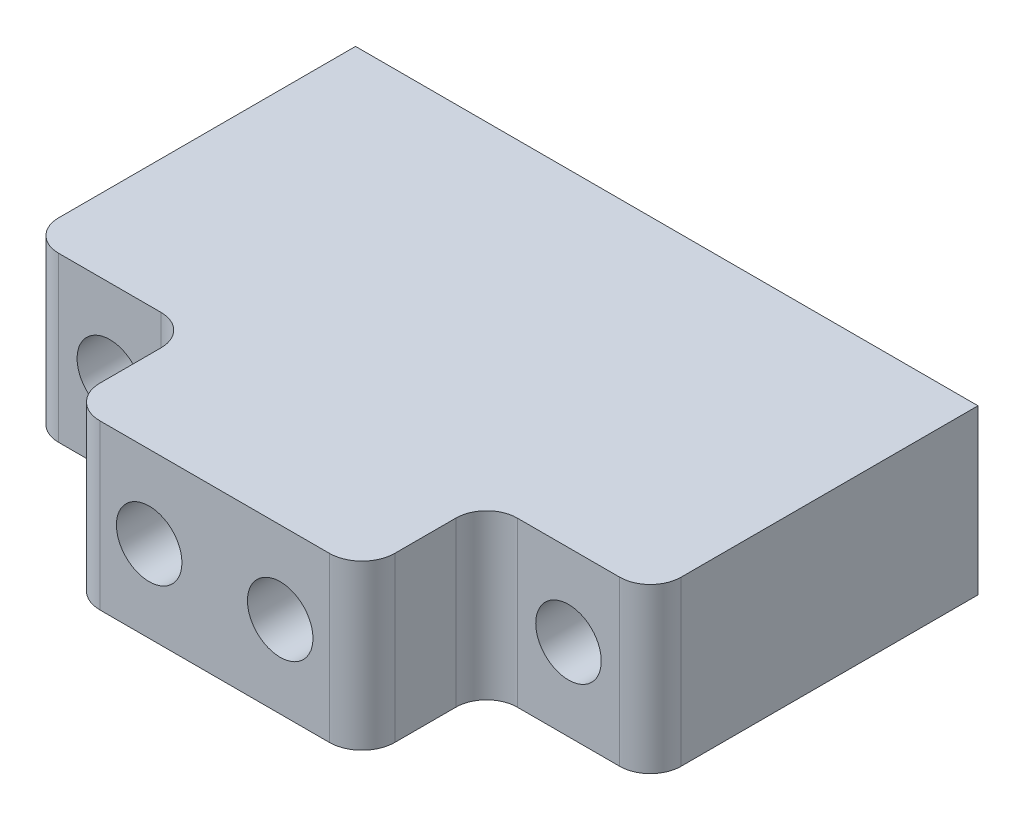
ISO-10303-21;
HEADER;
FILE_DESCRIPTION(('STEP AP214'),'2;1');
FILE_NAME('part.step','',(''),(''),'','','');
FILE_SCHEMA(('AUTOMOTIVE_DESIGN { 1 0 10303 214 1 1 1 1 }'));
ENDSEC;
DATA;
#1=APPLICATION_CONTEXT('core data for automotive mechanical design processes');
#2=APPLICATION_PROTOCOL_DEFINITION('international standard','automotive_design',2000,#1);
#3=PRODUCT_CONTEXT('',#1,'mechanical');
#4=PRODUCT('Part','Part','',(#3));
#5=PRODUCT_RELATED_PRODUCT_CATEGORY('part','',(#4));
#6=PRODUCT_DEFINITION_FORMATION('','',#4);
#7=PRODUCT_DEFINITION_CONTEXT('part definition',#1,'design');
#8=PRODUCT_DEFINITION('design','',#6,#7);
#9=PRODUCT_DEFINITION_SHAPE('','',#8);
#10=(LENGTH_UNIT() NAMED_UNIT(*) SI_UNIT(.MILLI.,.METRE.));
#11=(NAMED_UNIT(*) PLANE_ANGLE_UNIT() SI_UNIT($,.RADIAN.));
#12=(NAMED_UNIT(*) SI_UNIT($,.STERADIAN.) SOLID_ANGLE_UNIT());
#13=UNCERTAINTY_MEASURE_WITH_UNIT(LENGTH_MEASURE(1.E-05),#10,'distance_accuracy_value','');
#14=(GEOMETRIC_REPRESENTATION_CONTEXT(3) GLOBAL_UNCERTAINTY_ASSIGNED_CONTEXT((#13)) GLOBAL_UNIT_ASSIGNED_CONTEXT((#10,
#11,#12)) REPRESENTATION_CONTEXT('',''));
#15=CARTESIAN_POINT('',(0.,0.,0.));
#16=DIRECTION('',(0.,0.,1.));
#17=DIRECTION('',(1.,0.,0.));
#18=AXIS2_PLACEMENT_3D('',#15,#16,#17);
#19=CARTESIAN_POINT('',(17.78,0.,-5.08));
#20=DIRECTION('',(0.,0.,1.));
#21=DIRECTION('',(1.,0.,0.));
#22=AXIS2_PLACEMENT_3D('',#19,#20,#21);
#23=CYLINDRICAL_SURFACE('',#22,2.54);
#24=CARTESIAN_POINT('',(17.78,0.,20.32));
#25=DIRECTION('',(0.,0.,-1.));
#26=DIRECTION('',(-1.,0.,0.));
#27=AXIS2_PLACEMENT_3D('',#24,#25,#26);
#28=CIRCLE('',#27,2.54);
#29=CARTESIAN_POINT('',(15.24,0.,20.32));
#30=VERTEX_POINT('',#29);
#31=EDGE_CURVE('E199',#30,#30,#28,.T.);
#32=ORIENTED_EDGE('',*,*,#31,.F.);
#33=EDGE_LOOP('',(#32));
#34=FACE_BOUND('',#33,.T.);
#35=CARTESIAN_POINT('',(17.78,0.,-1.651));
#36=DIRECTION('',(0.,0.,-1.));
#37=DIRECTION('',(-1.,0.,0.));
#38=AXIS2_PLACEMENT_3D('',#35,#36,#37);
#39=CIRCLE('',#38,2.54);
#40=CARTESIAN_POINT('',(15.24,0.,-1.651));
#41=VERTEX_POINT('',#40);
#42=EDGE_CURVE('E196',#41,#41,#39,.F.);
#43=ORIENTED_EDGE('',*,*,#42,.F.);
#44=EDGE_LOOP('',(#43));
#45=FACE_BOUND('',#44,.T.);
#46=ADVANCED_FACE('F37',(#34,#45),#23,.F.);
#47=CARTESIAN_POINT('',(-17.78,0.,-5.08));
#48=DIRECTION('',(0.,0.,1.));
#49=DIRECTION('',(1.,0.,0.));
#50=AXIS2_PLACEMENT_3D('',#47,#48,#49);
#51=CYLINDRICAL_SURFACE('',#50,2.54);
#52=CARTESIAN_POINT('',(-17.78,0.,-1.651));
#53=DIRECTION('',(0.,0.,-1.));
#54=DIRECTION('',(-1.,0.,0.));
#55=AXIS2_PLACEMENT_3D('',#52,#53,#54);
#56=CIRCLE('',#55,2.54);
#57=CARTESIAN_POINT('',(-20.32,0.,-1.651));
#58=VERTEX_POINT('',#57);
#59=EDGE_CURVE('E191',#58,#58,#56,.F.);
#60=ORIENTED_EDGE('',*,*,#59,.F.);
#61=EDGE_LOOP('',(#60));
#62=FACE_BOUND('',#61,.T.);
#63=CARTESIAN_POINT('',(-17.78,0.,20.32));
#64=DIRECTION('',(0.,0.,-1.));
#65=DIRECTION('',(-1.,0.,0.));
#66=AXIS2_PLACEMENT_3D('',#63,#64,#65);
#67=CIRCLE('',#66,2.54);
#68=CARTESIAN_POINT('',(-20.32,0.,20.32));
#69=VERTEX_POINT('',#68);
#70=EDGE_CURVE('E241',#69,#69,#67,.T.);
#71=ORIENTED_EDGE('',*,*,#70,.F.);
#72=EDGE_LOOP('',(#71));
#73=FACE_BOUND('',#72,.T.);
#74=ADVANCED_FACE('F298',(#62,#73),#51,.F.);
#75=CARTESIAN_POINT('',(24.13,6.35,-5.08));
#76=DIRECTION('',(1.,0.,0.));
#77=DIRECTION('',(0.,0.,-1.));
#78=AXIS2_PLACEMENT_3D('',#75,#76,#77);
#79=PLANE('',#78);
#80=DIRECTION('',(0.,0.,1.));
#81=VECTOR('',#80,1.);
#82=CARTESIAN_POINT('',(24.13,6.35,-5.08));
#83=LINE('',#82,#81);
#84=CARTESIAN_POINT('',(24.13,6.35,-5.08));
#85=VERTEX_POINT('',#84);
#86=CARTESIAN_POINT('',(24.13,6.35,17.94));
#87=VERTEX_POINT('',#86);
#88=EDGE_CURVE('E135',#85,#87,#83,.T.);
#89=ORIENTED_EDGE('',*,*,#88,.T.);
#90=DIRECTION('',(0.,1.,0.));
#91=VECTOR('',#90,1.);
#92=CARTESIAN_POINT('',(24.13,6.35,17.94));
#93=LINE('',#92,#91);
#94=CARTESIAN_POINT('',(24.13,-6.35,17.94));
#95=VERTEX_POINT('',#94);
#96=EDGE_CURVE('E11',#87,#95,#93,.F.);
#97=ORIENTED_EDGE('',*,*,#96,.T.);
#98=DIRECTION('',(0.,0.,1.));
#99=VECTOR('',#98,1.);
#100=CARTESIAN_POINT('',(24.13,-6.35,-5.08));
#101=LINE('',#100,#99);
#102=CARTESIAN_POINT('',(24.13,-6.35,-5.08));
#103=VERTEX_POINT('',#102);
#104=EDGE_CURVE('E157',#103,#95,#101,.T.);
#105=ORIENTED_EDGE('',*,*,#104,.F.);
#106=DIRECTION('',(0.,1.,0.));
#107=VECTOR('',#106,1.);
#108=CARTESIAN_POINT('',(24.13,6.35,-5.08));
#109=LINE('',#108,#107);
#110=EDGE_CURVE('E150',#103,#85,#109,.T.);
#111=ORIENTED_EDGE('',*,*,#110,.T.);
#112=EDGE_LOOP('',(#89,#97,#105,#111));
#113=FACE_BOUND('',#112,.T.);
#114=ADVANCED_FACE('F155',(#113),#79,.T.);
#115=CARTESIAN_POINT('',(-24.13,-6.35000000000001,-5.08));
#116=DIRECTION('',(0.,-1.,0.));
#117=DIRECTION('',(1.,0.,0.));
#118=AXIS2_PLACEMENT_3D('',#115,#116,#117);
#119=PLANE('',#118);
#120=DIRECTION('',(1.,0.,0.));
#121=VECTOR('',#120,1.);
#122=CARTESIAN_POINT('',(-24.13,-6.35,20.32));
#123=LINE('',#122,#121);
#124=CARTESIAN_POINT('',(-21.75,-6.35,20.32));
#125=VERTEX_POINT('',#124);
#126=CARTESIAN_POINT('',(-13.81,-6.35,20.32));
#127=VERTEX_POINT('',#126);
#128=EDGE_CURVE('E244',#125,#127,#123,.T.);
#129=ORIENTED_EDGE('',*,*,#128,.F.);
#130=CARTESIAN_POINT('',(-21.75,-6.35000000000001,17.94));
#131=DIRECTION('',(0.,-1.,0.));
#132=DIRECTION('',(1.,0.,0.));
#133=AXIS2_PLACEMENT_3D('',#130,#131,#132);
#134=CIRCLE('',#133,2.38);
#135=CARTESIAN_POINT('',(-24.13,-6.35000000000001,17.94));
#136=VERTEX_POINT('',#135);
#137=EDGE_CURVE('E225',#125,#136,#134,.T.);
#138=ORIENTED_EDGE('',*,*,#137,.T.);
#139=DIRECTION('',(0.,0.,1.));
#140=VECTOR('',#139,1.);
#141=CARTESIAN_POINT('',(-24.13,-6.35000000000001,-5.08));
#142=LINE('',#141,#140);
#143=CARTESIAN_POINT('',(-24.13,-6.35000000000001,-5.08));
#144=VERTEX_POINT('',#143);
#145=EDGE_CURVE('E169',#144,#136,#142,.T.);
#146=ORIENTED_EDGE('',*,*,#145,.F.);
#147=DIRECTION('',(1.,0.,0.));
#148=VECTOR('',#147,1.);
#149=CARTESIAN_POINT('',(-24.13,-6.35000000000001,-5.08));
#150=LINE('',#149,#148);
#151=EDGE_CURVE('E143',#144,#103,#150,.T.);
#152=ORIENTED_EDGE('',*,*,#151,.T.);
#153=ORIENTED_EDGE('',*,*,#104,.T.);
#154=CARTESIAN_POINT('',(21.75,-6.35,17.94));
#155=DIRECTION('',(0.,-1.,0.));
#156=DIRECTION('',(1.,0.,0.));
#157=AXIS2_PLACEMENT_3D('',#154,#155,#156);
#158=CIRCLE('',#157,2.38);
#159=CARTESIAN_POINT('',(21.75,-6.35,20.32));
#160=VERTEX_POINT('',#159);
#161=EDGE_CURVE('E223',#95,#160,#158,.T.);
#162=ORIENTED_EDGE('',*,*,#161,.T.);
#163=DIRECTION('',(1.,0.,0.));
#164=VECTOR('',#163,1.);
#165=CARTESIAN_POINT('',(11.43,-6.35,20.32));
#166=LINE('',#165,#164);
#167=CARTESIAN_POINT('',(13.81,-6.35,20.32));
#168=VERTEX_POINT('',#167);
#169=EDGE_CURVE('E236',#168,#160,#166,.T.);
#170=ORIENTED_EDGE('',*,*,#169,.F.);
#171=CARTESIAN_POINT('',(13.81,-6.35,22.7));
#172=DIRECTION('',(0.,-1.,0.));
#173=DIRECTION('',(1.,0.,0.));
#174=AXIS2_PLACEMENT_3D('',#171,#172,#173);
#175=CIRCLE('',#174,2.38);
#176=CARTESIAN_POINT('',(11.43,-6.35,22.7));
#177=VERTEX_POINT('',#176);
#178=EDGE_CURVE('E205',#168,#177,#175,.F.);
#179=ORIENTED_EDGE('',*,*,#178,.T.);
#180=DIRECTION('',(0.,0.,-1.));
#181=VECTOR('',#180,1.);
#182=CARTESIAN_POINT('',(11.43,-6.35,27.94));
#183=LINE('',#182,#181);
#184=CARTESIAN_POINT('',(11.43,-6.35,27.432));
#185=VERTEX_POINT('',#184);
#186=EDGE_CURVE('E276',#185,#177,#183,.T.);
#187=ORIENTED_EDGE('',*,*,#186,.F.);
#188=CARTESIAN_POINT('',(8.89,-6.35000000000001,27.432));
#189=DIRECTION('',(0.,-1.,0.));
#190=DIRECTION('',(1.,0.,0.));
#191=AXIS2_PLACEMENT_3D('',#188,#189,#190);
#192=CIRCLE('',#191,2.54);
#193=CARTESIAN_POINT('',(8.89,-6.35,29.972));
#194=VERTEX_POINT('',#193);
#195=EDGE_CURVE('E186',#185,#194,#192,.T.);
#196=ORIENTED_EDGE('',*,*,#195,.T.);
#197=DIRECTION('',(1.,0.,0.));
#198=VECTOR('',#197,1.);
#199=CARTESIAN_POINT('',(-11.43,-6.35,29.972));
#200=LINE('',#199,#198);
#201=CARTESIAN_POINT('',(-8.89,-6.35,29.972));
#202=VERTEX_POINT('',#201);
#203=EDGE_CURVE('E269',#202,#194,#200,.T.);
#204=ORIENTED_EDGE('',*,*,#203,.F.);
#205=CARTESIAN_POINT('',(-8.89,-6.35000000000001,27.432));
#206=DIRECTION('',(0.,-1.,0.));
#207=DIRECTION('',(1.,0.,0.));
#208=AXIS2_PLACEMENT_3D('',#205,#206,#207);
#209=CIRCLE('',#208,2.54);
#210=CARTESIAN_POINT('',(-11.43,-6.35,27.432));
#211=VERTEX_POINT('',#210);
#212=EDGE_CURVE('E184',#202,#211,#209,.T.);
#213=ORIENTED_EDGE('',*,*,#212,.T.);
#214=DIRECTION('',(0.,0.,-1.));
#215=VECTOR('',#214,1.);
#216=CARTESIAN_POINT('',(-11.43,-6.35,27.94));
#217=LINE('',#216,#215);
#218=CARTESIAN_POINT('',(-11.43,-6.35,22.7));
#219=VERTEX_POINT('',#218);
#220=EDGE_CURVE('E161',#211,#219,#217,.T.);
#221=ORIENTED_EDGE('',*,*,#220,.T.);
#222=CARTESIAN_POINT('',(-13.81,-6.35000000000001,22.7));
#223=DIRECTION('',(0.,-1.,0.));
#224=DIRECTION('',(1.,0.,0.));
#225=AXIS2_PLACEMENT_3D('',#222,#223,#224);
#226=CIRCLE('',#225,2.38);
#227=EDGE_CURVE('E217',#219,#127,#226,.F.);
#228=ORIENTED_EDGE('',*,*,#227,.T.);
#229=EDGE_LOOP('',(#129,#138,#146,#152,#153,#162,#170,#179,#187,#196,#204,#213,#221,#228));
#230=FACE_BOUND('',#229,.T.);
#231=ADVANCED_FACE('F288',(#230),#119,.T.);
#232=CARTESIAN_POINT('',(-24.13,6.34999999999999,-5.08));
#233=DIRECTION('',(-1.,0.,0.));
#234=DIRECTION('',(0.,-1.,0.));
#235=AXIS2_PLACEMENT_3D('',#232,#233,#234);
#236=PLANE('',#235);
#237=ORIENTED_EDGE('',*,*,#145,.T.);
#238=DIRECTION('',(0.,-1.,0.));
#239=VECTOR('',#238,1.);
#240=CARTESIAN_POINT('',(-24.13,6.34999999999999,17.94));
#241=LINE('',#240,#239);
#242=CARTESIAN_POINT('',(-24.13,6.34999999999999,17.94));
#243=VERTEX_POINT('',#242);
#244=EDGE_CURVE('E227',#136,#243,#241,.F.);
#245=ORIENTED_EDGE('',*,*,#244,.T.);
#246=DIRECTION('',(0.,0.,1.));
#247=VECTOR('',#246,1.);
#248=CARTESIAN_POINT('',(-24.13,6.34999999999999,-5.08));
#249=LINE('',#248,#247);
#250=CARTESIAN_POINT('',(-24.13,6.34999999999999,-5.08));
#251=VERTEX_POINT('',#250);
#252=EDGE_CURVE('E142',#251,#243,#249,.T.);
#253=ORIENTED_EDGE('',*,*,#252,.F.);
#254=DIRECTION('',(0.,-1.,0.));
#255=VECTOR('',#254,1.);
#256=CARTESIAN_POINT('',(-24.13,6.34999999999999,-5.08));
#257=LINE('',#256,#255);
#258=EDGE_CURVE('E153',#251,#144,#257,.T.);
#259=ORIENTED_EDGE('',*,*,#258,.T.);
#260=EDGE_LOOP('',(#237,#245,#253,#259));
#261=FACE_BOUND('',#260,.T.);
#262=ADVANCED_FACE('F317',(#261),#236,.T.);
#263=CARTESIAN_POINT('',(-24.13,6.34999999999999,-5.08));
#264=DIRECTION('',(0.,1.,0.));
#265=DIRECTION('',(-1.,0.,0.));
#266=AXIS2_PLACEMENT_3D('',#263,#264,#265);
#267=PLANE('',#266);
#268=ORIENTED_EDGE('',*,*,#252,.T.);
#269=CARTESIAN_POINT('',(-21.75,6.34999999999999,17.94));
#270=DIRECTION('',(0.,1.,0.));
#271=DIRECTION('',(-1.,0.,0.));
#272=AXIS2_PLACEMENT_3D('',#269,#270,#271);
#273=CIRCLE('',#272,2.38);
#274=CARTESIAN_POINT('',(-21.75,6.34999999999999,20.32));
#275=VERTEX_POINT('',#274);
#276=EDGE_CURVE('E230',#243,#275,#273,.T.);
#277=ORIENTED_EDGE('',*,*,#276,.T.);
#278=DIRECTION('',(-1.,0.,0.));
#279=VECTOR('',#278,1.);
#280=CARTESIAN_POINT('',(-24.13,6.34999999999999,20.32));
#281=LINE('',#280,#279);
#282=CARTESIAN_POINT('',(-13.81,6.34999999999999,20.32));
#283=VERTEX_POINT('',#282);
#284=EDGE_CURVE('E250',#283,#275,#281,.T.);
#285=ORIENTED_EDGE('',*,*,#284,.F.);
#286=CARTESIAN_POINT('',(-13.81,6.35,22.7));
#287=DIRECTION('',(0.,1.,0.));
#288=DIRECTION('',(-1.,0.,0.));
#289=AXIS2_PLACEMENT_3D('',#286,#287,#288);
#290=CIRCLE('',#289,2.38);
#291=CARTESIAN_POINT('',(-11.43,6.35,22.7));
#292=VERTEX_POINT('',#291);
#293=EDGE_CURVE('E215',#283,#292,#290,.F.);
#294=ORIENTED_EDGE('',*,*,#293,.T.);
#295=DIRECTION('',(0.,0.,-1.));
#296=VECTOR('',#295,1.);
#297=CARTESIAN_POINT('',(-11.43,6.35,27.94));
#298=LINE('',#297,#296);
#299=CARTESIAN_POINT('',(-11.43,6.35,27.432));
#300=VERTEX_POINT('',#299);
#301=EDGE_CURVE('E158',#300,#292,#298,.T.);
#302=ORIENTED_EDGE('',*,*,#301,.F.);
#303=CARTESIAN_POINT('',(-8.89,6.35,27.432));
#304=DIRECTION('',(0.,1.,0.));
#305=DIRECTION('',(-1.,0.,0.));
#306=AXIS2_PLACEMENT_3D('',#303,#304,#305);
#307=CIRCLE('',#306,2.54);
#308=CARTESIAN_POINT('',(-8.89,6.35,29.972));
#309=VERTEX_POINT('',#308);
#310=EDGE_CURVE('E178',#300,#309,#307,.T.);
#311=ORIENTED_EDGE('',*,*,#310,.T.);
#312=DIRECTION('',(-1.,0.,0.));
#313=VECTOR('',#312,1.);
#314=CARTESIAN_POINT('',(-11.43,6.35,29.972));
#315=LINE('',#314,#313);
#316=CARTESIAN_POINT('',(8.89,6.35,29.972));
#317=VERTEX_POINT('',#316);
#318=EDGE_CURVE('E272',#317,#309,#315,.T.);
#319=ORIENTED_EDGE('',*,*,#318,.F.);
#320=CARTESIAN_POINT('',(8.89,6.35,27.432));
#321=DIRECTION('',(0.,1.,0.));
#322=DIRECTION('',(-1.,0.,0.));
#323=AXIS2_PLACEMENT_3D('',#320,#321,#322);
#324=CIRCLE('',#323,2.54);
#325=CARTESIAN_POINT('',(11.43,6.35,27.432));
#326=VERTEX_POINT('',#325);
#327=EDGE_CURVE('E180',#317,#326,#324,.T.);
#328=ORIENTED_EDGE('',*,*,#327,.T.);
#329=DIRECTION('',(0.,0.,-1.));
#330=VECTOR('',#329,1.);
#331=CARTESIAN_POINT('',(11.43,6.35,27.94));
#332=LINE('',#331,#330);
#333=CARTESIAN_POINT('',(11.43,6.35,22.7));
#334=VERTEX_POINT('',#333);
#335=EDGE_CURVE('E275',#326,#334,#332,.T.);
#336=ORIENTED_EDGE('',*,*,#335,.T.);
#337=CARTESIAN_POINT('',(13.81,6.35,22.7));
#338=DIRECTION('',(0.,1.,0.));
#339=DIRECTION('',(-1.,0.,0.));
#340=AXIS2_PLACEMENT_3D('',#337,#338,#339);
#341=CIRCLE('',#340,2.38);
#342=CARTESIAN_POINT('',(13.81,6.35,20.32));
#343=VERTEX_POINT('',#342);
#344=EDGE_CURVE('E207',#334,#343,#341,.F.);
#345=ORIENTED_EDGE('',*,*,#344,.T.);
#346=DIRECTION('',(-1.,0.,0.));
#347=VECTOR('',#346,1.);
#348=CARTESIAN_POINT('',(11.43,6.35,20.32));
#349=LINE('',#348,#347);
#350=CARTESIAN_POINT('',(21.75,6.35,20.32));
#351=VERTEX_POINT('',#350);
#352=EDGE_CURVE('E234',#351,#343,#349,.T.);
#353=ORIENTED_EDGE('',*,*,#352,.F.);
#354=CARTESIAN_POINT('',(21.75,6.35,17.94));
#355=DIRECTION('',(0.,1.,0.));
#356=DIRECTION('',(-1.,0.,0.));
#357=AXIS2_PLACEMENT_3D('',#354,#355,#356);
#358=CIRCLE('',#357,2.38);
#359=EDGE_CURVE('E52',#351,#87,#358,.T.);
#360=ORIENTED_EDGE('',*,*,#359,.T.);
#361=ORIENTED_EDGE('',*,*,#88,.F.);
#362=DIRECTION('',(-1.,0.,0.));
#363=VECTOR('',#362,1.);
#364=CARTESIAN_POINT('',(-24.13,6.34999999999999,-5.08));
#365=LINE('',#364,#363);
#366=EDGE_CURVE('E139',#85,#251,#365,.T.);
#367=ORIENTED_EDGE('',*,*,#366,.T.);
#368=EDGE_LOOP('',(#268,#277,#285,#294,#302,#311,#319,#328,#336,#345,#353,#360,#361,#367));
#369=FACE_BOUND('',#368,.T.);
#370=ADVANCED_FACE('F138',(#369),#267,.T.);
#371=CARTESIAN_POINT('',(0.,0.,-5.08));
#372=DIRECTION('',(0.,0.,1.));
#373=DIRECTION('',(1.,0.,0.));
#374=AXIS2_PLACEMENT_3D('',#371,#372,#373);
#375=PLANE('',#374);
#376=CARTESIAN_POINT('',(17.78,0.,-5.08));
#377=DIRECTION('',(0.,0.,-1.));
#378=DIRECTION('',(-1.,0.,0.));
#379=AXIS2_PLACEMENT_3D('',#376,#377,#378);
#380=CIRCLE('',#379,4.8006);
#381=CARTESIAN_POINT('',(12.9794,0.,-5.08));
#382=VERTEX_POINT('',#381);
#383=EDGE_CURVE('E407',#382,#382,#380,.T.);
#384=ORIENTED_EDGE('',*,*,#383,.F.);
#385=EDGE_LOOP('',(#384));
#386=FACE_BOUND('',#385,.T.);
#387=CARTESIAN_POINT('',(-17.78,0.,-5.08));
#388=DIRECTION('',(0.,0.,-1.));
#389=DIRECTION('',(-1.,0.,0.));
#390=AXIS2_PLACEMENT_3D('',#387,#388,#389);
#391=CIRCLE('',#390,4.8006);
#392=CARTESIAN_POINT('',(-22.5806,0.,-5.08));
#393=VERTEX_POINT('',#392);
#394=EDGE_CURVE('E253',#393,#393,#391,.T.);
#395=ORIENTED_EDGE('',*,*,#394,.F.);
#396=EDGE_LOOP('',(#395));
#397=FACE_BOUND('',#396,.T.);
#398=ORIENTED_EDGE('',*,*,#110,.F.);
#399=ORIENTED_EDGE('',*,*,#151,.F.);
#400=ORIENTED_EDGE('',*,*,#258,.F.);
#401=ORIENTED_EDGE('',*,*,#366,.F.);
#402=EDGE_LOOP('',(#398,#399,#400,#401));
#403=FACE_BOUND('',#402,.T.);
#404=ADVANCED_FACE('F148',(#386,#397,#403),#375,.F.);
#405=CARTESIAN_POINT('',(-11.43,6.35,27.94));
#406=DIRECTION('',(1.,0.,0.));
#407=DIRECTION('',(0.,0.,-1.));
#408=AXIS2_PLACEMENT_3D('',#405,#406,#407);
#409=PLANE('',#408);
#410=ORIENTED_EDGE('',*,*,#301,.T.);
#411=DIRECTION('',(0.,1.,0.));
#412=VECTOR('',#411,1.);
#413=CARTESIAN_POINT('',(-11.43,6.35,22.7));
#414=LINE('',#413,#412);
#415=EDGE_CURVE('E213',#292,#219,#414,.F.);
#416=ORIENTED_EDGE('',*,*,#415,.T.);
#417=ORIENTED_EDGE('',*,*,#220,.F.);
#418=DIRECTION('',(0.,-1.,0.));
#419=VECTOR('',#418,1.);
#420=CARTESIAN_POINT('',(-11.43,6.35,27.432));
#421=LINE('',#420,#419);
#422=EDGE_CURVE('E188',#211,#300,#421,.F.);
#423=ORIENTED_EDGE('',*,*,#422,.T.);
#424=EDGE_LOOP('',(#410,#416,#417,#423));
#425=FACE_BOUND('',#424,.T.);
#426=ADVANCED_FACE('F309',(#425),#409,.F.);
#427=CARTESIAN_POINT('',(11.43,6.35,27.94));
#428=DIRECTION('',(1.,0.,0.));
#429=DIRECTION('',(0.,0.,-1.));
#430=AXIS2_PLACEMENT_3D('',#427,#428,#429);
#431=PLANE('',#430);
#432=ORIENTED_EDGE('',*,*,#186,.T.);
#433=DIRECTION('',(0.,-1.,0.));
#434=VECTOR('',#433,1.);
#435=CARTESIAN_POINT('',(11.43,6.35,22.7));
#436=LINE('',#435,#434);
#437=EDGE_CURVE('E203',#177,#334,#436,.F.);
#438=ORIENTED_EDGE('',*,*,#437,.T.);
#439=ORIENTED_EDGE('',*,*,#335,.F.);
#440=DIRECTION('',(0.,1.,0.));
#441=VECTOR('',#440,1.);
#442=CARTESIAN_POINT('',(11.43,6.35,27.432));
#443=LINE('',#442,#441);
#444=EDGE_CURVE('E182',#326,#185,#443,.F.);
#445=ORIENTED_EDGE('',*,*,#444,.T.);
#446=EDGE_LOOP('',(#432,#438,#439,#445));
#447=FACE_BOUND('',#446,.T.);
#448=ADVANCED_FACE('F357',(#447),#431,.T.);
#449=CARTESIAN_POINT('',(0.,0.,29.972));
#450=DIRECTION('',(0.,0.,1.));
#451=DIRECTION('',(1.,0.,0.));
#452=AXIS2_PLACEMENT_3D('',#449,#450,#451);
#453=PLANE('',#452);
#454=CARTESIAN_POINT('',(5.08,0.,29.972));
#455=DIRECTION('',(0.,0.,1.));
#456=DIRECTION('',(1.,0.,0.));
#457=AXIS2_PLACEMENT_3D('',#454,#455,#456);
#458=CIRCLE('',#457,2.54);
#459=CARTESIAN_POINT('',(7.62,0.,29.972));
#460=VERTEX_POINT('',#459);
#461=EDGE_CURVE('E263',#460,#460,#458,.T.);
#462=ORIENTED_EDGE('',*,*,#461,.F.);
#463=EDGE_LOOP('',(#462));
#464=FACE_BOUND('',#463,.T.);
#465=CARTESIAN_POINT('',(-5.08,0.,29.972));
#466=DIRECTION('',(0.,0.,1.));
#467=DIRECTION('',(1.,0.,0.));
#468=AXIS2_PLACEMENT_3D('',#465,#466,#467);
#469=CIRCLE('',#468,2.54);
#470=CARTESIAN_POINT('',(-2.54,0.,29.972));
#471=VERTEX_POINT('',#470);
#472=EDGE_CURVE('E266',#471,#471,#469,.T.);
#473=ORIENTED_EDGE('',*,*,#472,.F.);
#474=EDGE_LOOP('',(#473));
#475=FACE_BOUND('',#474,.T.);
#476=ORIENTED_EDGE('',*,*,#203,.T.);
#477=DIRECTION('',(0.,1.,0.));
#478=VECTOR('',#477,1.);
#479=CARTESIAN_POINT('',(8.89,0.,29.972));
#480=LINE('',#479,#478);
#481=EDGE_CURVE('E175',#194,#317,#480,.T.);
#482=ORIENTED_EDGE('',*,*,#481,.T.);
#483=ORIENTED_EDGE('',*,*,#318,.T.);
#484=DIRECTION('',(0.,-1.,0.));
#485=VECTOR('',#484,1.);
#486=CARTESIAN_POINT('',(-8.89,-6.35,29.972));
#487=LINE('',#486,#485);
#488=EDGE_CURVE('E168',#309,#202,#487,.T.);
#489=ORIENTED_EDGE('',*,*,#488,.T.);
#490=EDGE_LOOP('',(#476,#482,#483,#489));
#491=FACE_BOUND('',#490,.T.);
#492=ADVANCED_FACE('F354',(#464,#475,#491),#453,.T.);
#493=CARTESIAN_POINT('',(-5.08,0.,27.94));
#494=DIRECTION('',(0.,0.,1.));
#495=DIRECTION('',(1.,0.,0.));
#496=AXIS2_PLACEMENT_3D('',#493,#494,#495);
#497=CYLINDRICAL_SURFACE('',#496,2.54);
#498=ORIENTED_EDGE('',*,*,#472,.T.);
#499=EDGE_LOOP('',(#498));
#500=FACE_BOUND('',#499,.T.);
#501=CARTESIAN_POINT('',(-5.08,0.,20.447));
#502=DIRECTION('',(0.,0.,1.));
#503=DIRECTION('',(1.,0.,0.));
#504=AXIS2_PLACEMENT_3D('',#501,#502,#503);
#505=CIRCLE('',#504,2.54);
#506=CARTESIAN_POINT('',(-2.54,0.,20.447));
#507=VERTEX_POINT('',#506);
#508=EDGE_CURVE('E260',#507,#507,#505,.T.);
#509=ORIENTED_EDGE('',*,*,#508,.F.);
#510=EDGE_LOOP('',(#509));
#511=FACE_BOUND('',#510,.T.);
#512=ADVANCED_FACE('F363',(#500,#511),#497,.F.);
#513=CARTESIAN_POINT('',(5.08,0.,27.94));
#514=DIRECTION('',(0.,0.,1.));
#515=DIRECTION('',(1.,0.,0.));
#516=AXIS2_PLACEMENT_3D('',#513,#514,#515);
#517=CYLINDRICAL_SURFACE('',#516,2.54);
#518=ORIENTED_EDGE('',*,*,#461,.T.);
#519=EDGE_LOOP('',(#518));
#520=FACE_BOUND('',#519,.T.);
#521=CARTESIAN_POINT('',(5.08,0.,20.447));
#522=DIRECTION('',(0.,0.,1.));
#523=DIRECTION('',(1.,0.,0.));
#524=AXIS2_PLACEMENT_3D('',#521,#522,#523);
#525=CIRCLE('',#524,2.54);
#526=CARTESIAN_POINT('',(7.62,0.,20.447));
#527=VERTEX_POINT('',#526);
#528=EDGE_CURVE('E194',#527,#527,#525,.T.);
#529=ORIENTED_EDGE('',*,*,#528,.F.);
#530=EDGE_LOOP('',(#529));
#531=FACE_BOUND('',#530,.T.);
#532=ADVANCED_FACE('F329',(#520,#531),#517,.F.);
#533=CARTESIAN_POINT('',(8.89,0.,27.432));
#534=DIRECTION('',(0.,1.,0.));
#535=DIRECTION('',(0.,0.,1.));
#536=AXIS2_PLACEMENT_3D('',#533,#534,#535);
#537=CYLINDRICAL_SURFACE('',#536,2.54);
#538=ORIENTED_EDGE('',*,*,#195,.F.);
#539=ORIENTED_EDGE('',*,*,#444,.F.);
#540=ORIENTED_EDGE('',*,*,#327,.F.);
#541=ORIENTED_EDGE('',*,*,#481,.F.);
#542=EDGE_LOOP('',(#538,#539,#540,#541));
#543=FACE_BOUND('',#542,.T.);
#544=ADVANCED_FACE('F325',(#543),#537,.T.);
#545=CARTESIAN_POINT('',(-8.89,0.,27.432));
#546=DIRECTION('',(0.,1.,0.));
#547=DIRECTION('',(0.,0.,1.));
#548=AXIS2_PLACEMENT_3D('',#545,#546,#547);
#549=CYLINDRICAL_SURFACE('',#548,2.54);
#550=ORIENTED_EDGE('',*,*,#310,.F.);
#551=ORIENTED_EDGE('',*,*,#422,.F.);
#552=ORIENTED_EDGE('',*,*,#212,.F.);
#553=ORIENTED_EDGE('',*,*,#488,.F.);
#554=EDGE_LOOP('',(#550,#551,#552,#553));
#555=FACE_BOUND('',#554,.T.);
#556=ADVANCED_FACE('F328',(#555),#549,.T.);
#557=CARTESIAN_POINT('',(-5.08,0.,20.447));
#558=DIRECTION('',(0.,0.,1.));
#559=DIRECTION('',(1.,0.,0.));
#560=AXIS2_PLACEMENT_3D('',#557,#558,#559);
#561=PLANE('',#560);
#562=ORIENTED_EDGE('',*,*,#508,.T.);
#563=EDGE_LOOP('',(#562));
#564=FACE_BOUND('',#563,.T.);
#565=ADVANCED_FACE('F333',(#564),#561,.T.);
#566=CARTESIAN_POINT('',(5.08,0.,20.447));
#567=DIRECTION('',(0.,0.,1.));
#568=DIRECTION('',(1.,0.,0.));
#569=AXIS2_PLACEMENT_3D('',#566,#567,#568);
#570=PLANE('',#569);
#571=ORIENTED_EDGE('',*,*,#528,.T.);
#572=EDGE_LOOP('',(#571));
#573=FACE_BOUND('',#572,.T.);
#574=ADVANCED_FACE('F375',(#573),#570,.T.);
#575=CARTESIAN_POINT('',(-17.78,0.,-1.651));
#576=DIRECTION('',(0.,0.,-1.));
#577=DIRECTION('',(-1.,0.,0.));
#578=AXIS2_PLACEMENT_3D('',#575,#576,#577);
#579=PLANE('',#578);
#580=CARTESIAN_POINT('',(-17.78,0.,-1.651));
#581=DIRECTION('',(0.,0.,-1.));
#582=DIRECTION('',(-1.,0.,0.));
#583=AXIS2_PLACEMENT_3D('',#580,#581,#582);
#584=CIRCLE('',#583,4.8006);
#585=CARTESIAN_POINT('',(-22.5806,0.,-1.651));
#586=VERTEX_POINT('',#585);
#587=EDGE_CURVE('E195',#586,#586,#584,.T.);
#588=ORIENTED_EDGE('',*,*,#587,.T.);
#589=EDGE_LOOP('',(#588));
#590=FACE_BOUND('',#589,.T.);
#591=ORIENTED_EDGE('',*,*,#59,.T.);
#592=EDGE_LOOP('',(#591));
#593=FACE_BOUND('',#592,.T.);
#594=ADVANCED_FACE('F379',(#590,#593),#579,.T.);
#595=CARTESIAN_POINT('',(-17.78,0.,-1.651));
#596=DIRECTION('',(0.,0.,-1.));
#597=DIRECTION('',(-1.,0.,0.));
#598=AXIS2_PLACEMENT_3D('',#595,#596,#597);
#599=CYLINDRICAL_SURFACE('',#598,4.8006);
#600=ORIENTED_EDGE('',*,*,#587,.F.);
#601=EDGE_LOOP('',(#600));
#602=FACE_BOUND('',#601,.T.);
#603=ORIENTED_EDGE('',*,*,#394,.T.);
#604=EDGE_LOOP('',(#603));
#605=FACE_BOUND('',#604,.T.);
#606=ADVANCED_FACE('F381',(#602,#605),#599,.F.);
#607=CARTESIAN_POINT('',(0.,0.,20.32));
#608=DIRECTION('',(0.,0.,1.));
#609=DIRECTION('',(1.,0.,0.));
#610=AXIS2_PLACEMENT_3D('',#607,#608,#609);
#611=PLANE('',#610);
#612=ORIENTED_EDGE('',*,*,#70,.T.);
#613=EDGE_LOOP('',(#612));
#614=FACE_BOUND('',#613,.T.);
#615=ORIENTED_EDGE('',*,*,#284,.T.);
#616=DIRECTION('',(0.,-1.,0.));
#617=VECTOR('',#616,1.);
#618=CARTESIAN_POINT('',(-21.75,0.,20.32));
#619=LINE('',#618,#617);
#620=EDGE_CURVE('E220',#275,#125,#619,.T.);
#621=ORIENTED_EDGE('',*,*,#620,.T.);
#622=ORIENTED_EDGE('',*,*,#128,.T.);
#623=DIRECTION('',(0.,1.,0.));
#624=VECTOR('',#623,1.);
#625=CARTESIAN_POINT('',(-13.81,0.,20.32));
#626=LINE('',#625,#624);
#627=EDGE_CURVE('E210',#127,#283,#626,.T.);
#628=ORIENTED_EDGE('',*,*,#627,.T.);
#629=EDGE_LOOP('',(#615,#621,#622,#628));
#630=FACE_BOUND('',#629,.T.);
#631=ADVANCED_FACE('F384',(#614,#630),#611,.T.);
#632=CARTESIAN_POINT('',(0.,0.,20.32));
#633=DIRECTION('',(0.,0.,1.));
#634=DIRECTION('',(1.,0.,0.));
#635=AXIS2_PLACEMENT_3D('',#632,#633,#634);
#636=PLANE('',#635);
#637=ORIENTED_EDGE('',*,*,#31,.T.);
#638=EDGE_LOOP('',(#637));
#639=FACE_BOUND('',#638,.T.);
#640=ORIENTED_EDGE('',*,*,#169,.T.);
#641=DIRECTION('',(0.,1.,0.));
#642=VECTOR('',#641,1.);
#643=CARTESIAN_POINT('',(21.75,0.,20.32));
#644=LINE('',#643,#642);
#645=EDGE_CURVE('E45',#160,#351,#644,.T.);
#646=ORIENTED_EDGE('',*,*,#645,.T.);
#647=ORIENTED_EDGE('',*,*,#352,.T.);
#648=DIRECTION('',(0.,-1.,0.));
#649=VECTOR('',#648,1.);
#650=CARTESIAN_POINT('',(13.81,-6.35,20.32));
#651=LINE('',#650,#649);
#652=EDGE_CURVE('E190',#343,#168,#651,.T.);
#653=ORIENTED_EDGE('',*,*,#652,.T.);
#654=EDGE_LOOP('',(#640,#646,#647,#653));
#655=FACE_BOUND('',#654,.T.);
#656=ADVANCED_FACE('F233',(#639,#655),#636,.T.);
#657=CARTESIAN_POINT('',(17.78,0.,-1.651));
#658=DIRECTION('',(0.,0.,-1.));
#659=DIRECTION('',(-1.,0.,0.));
#660=AXIS2_PLACEMENT_3D('',#657,#658,#659);
#661=PLANE('',#660);
#662=CARTESIAN_POINT('',(17.78,0.,-1.651));
#663=DIRECTION('',(0.,0.,-1.));
#664=DIRECTION('',(-1.,0.,0.));
#665=AXIS2_PLACEMENT_3D('',#662,#663,#664);
#666=CIRCLE('',#665,4.8006);
#667=CARTESIAN_POINT('',(12.9794,0.,-1.651));
#668=VERTEX_POINT('',#667);
#669=EDGE_CURVE('E200',#668,#668,#666,.T.);
#670=ORIENTED_EDGE('',*,*,#669,.T.);
#671=EDGE_LOOP('',(#670));
#672=FACE_BOUND('',#671,.T.);
#673=ORIENTED_EDGE('',*,*,#42,.T.);
#674=EDGE_LOOP('',(#673));
#675=FACE_BOUND('',#674,.T.);
#676=ADVANCED_FACE('F394',(#672,#675),#661,.T.);
#677=CARTESIAN_POINT('',(17.78,0.,-1.651));
#678=DIRECTION('',(0.,0.,-1.));
#679=DIRECTION('',(-1.,0.,0.));
#680=AXIS2_PLACEMENT_3D('',#677,#678,#679);
#681=CYLINDRICAL_SURFACE('',#680,4.8006);
#682=ORIENTED_EDGE('',*,*,#669,.F.);
#683=EDGE_LOOP('',(#682));
#684=FACE_BOUND('',#683,.T.);
#685=ORIENTED_EDGE('',*,*,#383,.T.);
#686=EDGE_LOOP('',(#685));
#687=FACE_BOUND('',#686,.T.);
#688=ADVANCED_FACE('F337',(#684,#687),#681,.F.);
#689=CARTESIAN_POINT('',(13.81,0.,22.7));
#690=DIRECTION('',(0.,1.,0.));
#691=DIRECTION('',(0.,0.,1.));
#692=AXIS2_PLACEMENT_3D('',#689,#690,#691);
#693=CYLINDRICAL_SURFACE('',#692,2.38);
#694=ORIENTED_EDGE('',*,*,#344,.F.);
#695=ORIENTED_EDGE('',*,*,#437,.F.);
#696=ORIENTED_EDGE('',*,*,#178,.F.);
#697=ORIENTED_EDGE('',*,*,#652,.F.);
#698=EDGE_LOOP('',(#694,#695,#696,#697));
#699=FACE_BOUND('',#698,.T.);
#700=ADVANCED_FACE('F285',(#699),#693,.F.);
#701=CARTESIAN_POINT('',(-13.81,0.,22.7));
#702=DIRECTION('',(0.,1.,0.));
#703=DIRECTION('',(0.,0.,1.));
#704=AXIS2_PLACEMENT_3D('',#701,#702,#703);
#705=CYLINDRICAL_SURFACE('',#704,2.38);
#706=ORIENTED_EDGE('',*,*,#227,.F.);
#707=ORIENTED_EDGE('',*,*,#415,.F.);
#708=ORIENTED_EDGE('',*,*,#293,.F.);
#709=ORIENTED_EDGE('',*,*,#627,.F.);
#710=EDGE_LOOP('',(#706,#707,#708,#709));
#711=FACE_BOUND('',#710,.T.);
#712=ADVANCED_FACE('F295',(#711),#705,.F.);
#713=CARTESIAN_POINT('',(-21.75,0.,17.94));
#714=DIRECTION('',(0.,-1.,0.));
#715=DIRECTION('',(1.,0.,0.));
#716=AXIS2_PLACEMENT_3D('',#713,#714,#715);
#717=CYLINDRICAL_SURFACE('',#716,2.38);
#718=ORIENTED_EDGE('',*,*,#276,.F.);
#719=ORIENTED_EDGE('',*,*,#244,.F.);
#720=ORIENTED_EDGE('',*,*,#137,.F.);
#721=ORIENTED_EDGE('',*,*,#620,.F.);
#722=EDGE_LOOP('',(#718,#719,#720,#721));
#723=FACE_BOUND('',#722,.T.);
#724=ADVANCED_FACE('F291',(#723),#717,.T.);
#725=CARTESIAN_POINT('',(21.75,0.,17.94));
#726=DIRECTION('',(0.,1.,0.));
#727=DIRECTION('',(0.,0.,1.));
#728=AXIS2_PLACEMENT_3D('',#725,#726,#727);
#729=CYLINDRICAL_SURFACE('',#728,2.38);
#730=ORIENTED_EDGE('',*,*,#161,.F.);
#731=ORIENTED_EDGE('',*,*,#96,.F.);
#732=ORIENTED_EDGE('',*,*,#359,.F.);
#733=ORIENTED_EDGE('',*,*,#645,.F.);
#734=EDGE_LOOP('',(#730,#731,#732,#733));
#735=FACE_BOUND('',#734,.T.);
#736=ADVANCED_FACE('F39',(#735),#729,.T.);
#737=CLOSED_SHELL('',(#46,#74,#114,#231,#262,#370,#404,#426,#448,#492,#512,#532,#544,#556,#565,
#574,#594,#606,#631,#656,#676,#688,#700,#712,#724,#736));
#738=MANIFOLD_SOLID_BREP('B2',#737);
#739=ADVANCED_BREP_SHAPE_REPRESENTATION('',(#18,#738),#14);
#740=SHAPE_DEFINITION_REPRESENTATION(#9,#739);
ENDSEC;
END-ISO-10303-21;
